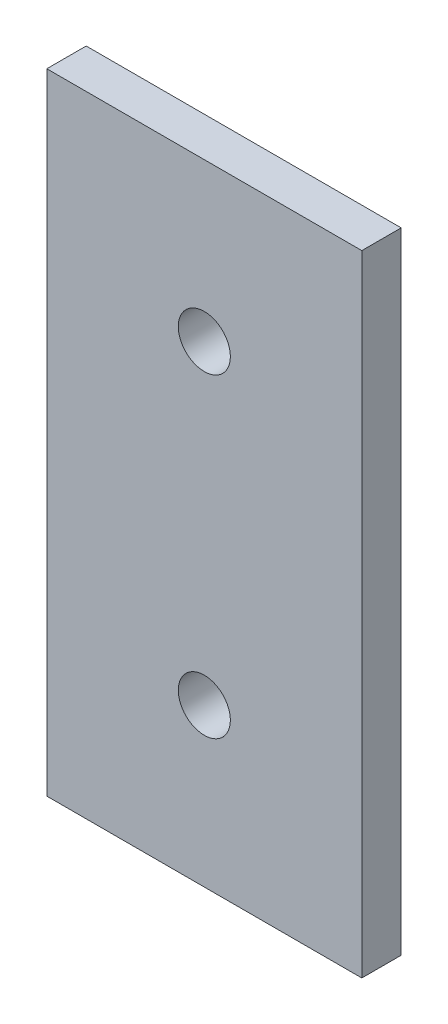
ISO-10303-21;
HEADER;
FILE_DESCRIPTION(('STEP AP214'),'2;1');
FILE_NAME('part.step','',(''),(''),'','','');
FILE_SCHEMA(('AUTOMOTIVE_DESIGN { 1 0 10303 214 1 1 1 1 }'));
ENDSEC;
DATA;
#1=APPLICATION_CONTEXT('core data for automotive mechanical design processes');
#2=APPLICATION_PROTOCOL_DEFINITION('international standard','automotive_design',2000,#1);
#3=PRODUCT_CONTEXT('',#1,'mechanical');
#4=PRODUCT('Part','Part','',(#3));
#5=PRODUCT_RELATED_PRODUCT_CATEGORY('part','',(#4));
#6=PRODUCT_DEFINITION_FORMATION('','',#4);
#7=PRODUCT_DEFINITION_CONTEXT('part definition',#1,'design');
#8=PRODUCT_DEFINITION('design','',#6,#7);
#9=PRODUCT_DEFINITION_SHAPE('','',#8);
#10=(LENGTH_UNIT() NAMED_UNIT(*) SI_UNIT(.MILLI.,.METRE.));
#11=(NAMED_UNIT(*) PLANE_ANGLE_UNIT() SI_UNIT($,.RADIAN.));
#12=(NAMED_UNIT(*) SI_UNIT($,.STERADIAN.) SOLID_ANGLE_UNIT());
#13=UNCERTAINTY_MEASURE_WITH_UNIT(LENGTH_MEASURE(1.E-05),#10,'distance_accuracy_value','');
#14=(GEOMETRIC_REPRESENTATION_CONTEXT(3) GLOBAL_UNCERTAINTY_ASSIGNED_CONTEXT((#13)) GLOBAL_UNIT_ASSIGNED_CONTEXT((#10,
#11,#12)) REPRESENTATION_CONTEXT('',''));
#15=CARTESIAN_POINT('',(0.,0.,0.));
#16=DIRECTION('',(0.,0.,1.));
#17=DIRECTION('',(1.,0.,0.));
#18=AXIS2_PLACEMENT_3D('',#15,#16,#17);
#19=CARTESIAN_POINT('',(0.,0.,3.175));
#20=DIRECTION('',(0.,0.,-1.));
#21=DIRECTION('',(-1.,0.,0.));
#22=AXIS2_PLACEMENT_3D('',#19,#20,#21);
#23=PLANE('',#22);
#24=DIRECTION('',(0.,1.,0.));
#25=VECTOR('',#24,1.);
#26=CARTESIAN_POINT('',(12.7,-25.4,3.175));
#27=LINE('',#26,#25);
#28=CARTESIAN_POINT('',(12.7,-25.4,3.175));
#29=VERTEX_POINT('',#28);
#30=CARTESIAN_POINT('',(12.7,25.4,3.175));
#31=VERTEX_POINT('',#30);
#32=EDGE_CURVE('E92',#29,#31,#27,.T.);
#33=ORIENTED_EDGE('',*,*,#32,.T.);
#34=DIRECTION('',(-1.,0.,0.));
#35=VECTOR('',#34,1.);
#36=CARTESIAN_POINT('',(-12.7,25.4,3.175));
#37=LINE('',#36,#35);
#38=CARTESIAN_POINT('',(-12.7,25.4,3.175));
#39=VERTEX_POINT('',#38);
#40=EDGE_CURVE('E87',#31,#39,#37,.T.);
#41=ORIENTED_EDGE('',*,*,#40,.T.);
#42=DIRECTION('',(0.,-1.,0.));
#43=VECTOR('',#42,1.);
#44=CARTESIAN_POINT('',(-12.7,-25.4,3.175));
#45=LINE('',#44,#43);
#46=CARTESIAN_POINT('',(-12.7,-25.4,3.175));
#47=VERTEX_POINT('',#46);
#48=EDGE_CURVE('E90',#39,#47,#45,.T.);
#49=ORIENTED_EDGE('',*,*,#48,.T.);
#50=DIRECTION('',(1.,0.,0.));
#51=VECTOR('',#50,1.);
#52=CARTESIAN_POINT('',(-12.7,-25.4,3.175));
#53=LINE('',#52,#51);
#54=EDGE_CURVE('E57',#47,#29,#53,.T.);
#55=ORIENTED_EDGE('',*,*,#54,.T.);
#56=EDGE_LOOP('',(#33,#41,#49,#55));
#57=FACE_BOUND('',#56,.T.);
#58=CARTESIAN_POINT('',(0.,12.7,3.175));
#59=DIRECTION('',(0.,0.,1.));
#60=DIRECTION('',(1.,0.,0.));
#61=AXIS2_PLACEMENT_3D('',#58,#59,#60);
#62=CIRCLE('',#61,2.1);
#63=CARTESIAN_POINT('',(2.1,12.7,3.175));
#64=VERTEX_POINT('',#63);
#65=EDGE_CURVE('E112',#64,#64,#62,.T.);
#66=ORIENTED_EDGE('',*,*,#65,.F.);
#67=EDGE_LOOP('',(#66));
#68=FACE_BOUND('',#67,.T.);
#69=CARTESIAN_POINT('',(0.,-12.7,3.175));
#70=DIRECTION('',(0.,0.,1.));
#71=DIRECTION('',(1.,0.,0.));
#72=AXIS2_PLACEMENT_3D('',#69,#70,#71);
#73=CIRCLE('',#72,2.1);
#74=CARTESIAN_POINT('',(2.1,-12.7,3.175));
#75=VERTEX_POINT('',#74);
#76=EDGE_CURVE('E134',#75,#75,#73,.T.);
#77=ORIENTED_EDGE('',*,*,#76,.F.);
#78=EDGE_LOOP('',(#77));
#79=FACE_BOUND('',#78,.T.);
#80=ADVANCED_FACE('F39',(#57,#68,#79),#23,.F.);
#81=CARTESIAN_POINT('',(0.,0.,0.));
#82=DIRECTION('',(0.,0.,-1.));
#83=DIRECTION('',(-1.,0.,0.));
#84=AXIS2_PLACEMENT_3D('',#81,#82,#83);
#85=PLANE('',#84);
#86=CARTESIAN_POINT('',(0.,12.7,0.));
#87=DIRECTION('',(0.,0.,1.));
#88=DIRECTION('',(1.,0.,0.));
#89=AXIS2_PLACEMENT_3D('',#86,#87,#88);
#90=CIRCLE('',#89,2.1);
#91=CARTESIAN_POINT('',(2.1,12.7,0.));
#92=VERTEX_POINT('',#91);
#93=EDGE_CURVE('E130',#92,#92,#90,.T.);
#94=ORIENTED_EDGE('',*,*,#93,.T.);
#95=EDGE_LOOP('',(#94));
#96=FACE_BOUND('',#95,.T.);
#97=DIRECTION('',(0.,1.,0.));
#98=VECTOR('',#97,1.);
#99=CARTESIAN_POINT('',(12.7,-25.4,0.));
#100=LINE('',#99,#98);
#101=CARTESIAN_POINT('',(12.7,-25.4,0.));
#102=VERTEX_POINT('',#101);
#103=CARTESIAN_POINT('',(12.7,25.4,0.));
#104=VERTEX_POINT('',#103);
#105=EDGE_CURVE('E108',#102,#104,#100,.T.);
#106=ORIENTED_EDGE('',*,*,#105,.F.);
#107=DIRECTION('',(1.,0.,0.));
#108=VECTOR('',#107,1.);
#109=CARTESIAN_POINT('',(-12.7,-25.4,0.));
#110=LINE('',#109,#108);
#111=CARTESIAN_POINT('',(-12.7,-25.4,0.));
#112=VERTEX_POINT('',#111);
#113=EDGE_CURVE('E80',#112,#102,#110,.T.);
#114=ORIENTED_EDGE('',*,*,#113,.F.);
#115=DIRECTION('',(0.,-1.,0.));
#116=VECTOR('',#115,1.);
#117=CARTESIAN_POINT('',(-12.7,-25.4,0.));
#118=LINE('',#117,#116);
#119=CARTESIAN_POINT('',(-12.7,25.4,0.));
#120=VERTEX_POINT('',#119);
#121=EDGE_CURVE('E74',#120,#112,#118,.T.);
#122=ORIENTED_EDGE('',*,*,#121,.F.);
#123=DIRECTION('',(-1.,0.,0.));
#124=VECTOR('',#123,1.);
#125=CARTESIAN_POINT('',(-12.7,25.4,0.));
#126=LINE('',#125,#124);
#127=EDGE_CURVE('E97',#104,#120,#126,.T.);
#128=ORIENTED_EDGE('',*,*,#127,.F.);
#129=EDGE_LOOP('',(#106,#114,#122,#128));
#130=FACE_BOUND('',#129,.T.);
#131=CARTESIAN_POINT('',(0.,-12.7,0.));
#132=DIRECTION('',(0.,0.,1.));
#133=DIRECTION('',(1.,0.,0.));
#134=AXIS2_PLACEMENT_3D('',#131,#132,#133);
#135=CIRCLE('',#134,2.1);
#136=CARTESIAN_POINT('',(2.1,-12.7,0.));
#137=VERTEX_POINT('',#136);
#138=EDGE_CURVE('E138',#137,#137,#135,.T.);
#139=ORIENTED_EDGE('',*,*,#138,.T.);
#140=EDGE_LOOP('',(#139));
#141=FACE_BOUND('',#140,.T.);
#142=ADVANCED_FACE('F125',(#96,#130,#141),#85,.T.);
#143=CARTESIAN_POINT('',(12.7,-25.4,3.175));
#144=DIRECTION('',(-1.,0.,0.));
#145=DIRECTION('',(0.,0.,1.));
#146=AXIS2_PLACEMENT_3D('',#143,#144,#145);
#147=PLANE('',#146);
#148=ORIENTED_EDGE('',*,*,#105,.T.);
#149=DIRECTION('',(0.,0.,-1.));
#150=VECTOR('',#149,1.);
#151=CARTESIAN_POINT('',(12.7,25.4,3.175));
#152=LINE('',#151,#150);
#153=EDGE_CURVE('E11',#31,#104,#152,.T.);
#154=ORIENTED_EDGE('',*,*,#153,.F.);
#155=ORIENTED_EDGE('',*,*,#32,.F.);
#156=DIRECTION('',(0.,0.,-1.));
#157=VECTOR('',#156,1.);
#158=CARTESIAN_POINT('',(12.7,-25.4,3.175));
#159=LINE('',#158,#157);
#160=EDGE_CURVE('E104',#29,#102,#159,.T.);
#161=ORIENTED_EDGE('',*,*,#160,.T.);
#162=EDGE_LOOP('',(#148,#154,#155,#161));
#163=FACE_BOUND('',#162,.T.);
#164=ADVANCED_FACE('F41',(#163),#147,.F.);
#165=CARTESIAN_POINT('',(-12.7,25.4,3.175));
#166=DIRECTION('',(0.,-1.,0.));
#167=DIRECTION('',(0.,0.,-1.));
#168=AXIS2_PLACEMENT_3D('',#165,#166,#167);
#169=PLANE('',#168);
#170=ORIENTED_EDGE('',*,*,#127,.T.);
#171=DIRECTION('',(0.,0.,-1.));
#172=VECTOR('',#171,1.);
#173=CARTESIAN_POINT('',(-12.7,25.4,3.175));
#174=LINE('',#173,#172);
#175=EDGE_CURVE('E49',#39,#120,#174,.T.);
#176=ORIENTED_EDGE('',*,*,#175,.F.);
#177=ORIENTED_EDGE('',*,*,#40,.F.);
#178=ORIENTED_EDGE('',*,*,#153,.T.);
#179=EDGE_LOOP('',(#170,#176,#177,#178));
#180=FACE_BOUND('',#179,.T.);
#181=ADVANCED_FACE('F96',(#180),#169,.F.);
#182=CARTESIAN_POINT('',(-12.7,-25.4,3.175));
#183=DIRECTION('',(1.,0.,0.));
#184=DIRECTION('',(0.,0.,-1.));
#185=AXIS2_PLACEMENT_3D('',#182,#183,#184);
#186=PLANE('',#185);
#187=ORIENTED_EDGE('',*,*,#121,.T.);
#188=DIRECTION('',(0.,0.,-1.));
#189=VECTOR('',#188,1.);
#190=CARTESIAN_POINT('',(-12.7,-25.4,3.175));
#191=LINE('',#190,#189);
#192=EDGE_CURVE('E99',#47,#112,#191,.T.);
#193=ORIENTED_EDGE('',*,*,#192,.F.);
#194=ORIENTED_EDGE('',*,*,#48,.F.);
#195=ORIENTED_EDGE('',*,*,#175,.T.);
#196=EDGE_LOOP('',(#187,#193,#194,#195));
#197=FACE_BOUND('',#196,.T.);
#198=ADVANCED_FACE('F100',(#197),#186,.F.);
#199=CARTESIAN_POINT('',(-12.7,-25.4,3.175));
#200=DIRECTION('',(0.,1.,0.));
#201=DIRECTION('',(0.,0.,1.));
#202=AXIS2_PLACEMENT_3D('',#199,#200,#201);
#203=PLANE('',#202);
#204=ORIENTED_EDGE('',*,*,#113,.T.);
#205=ORIENTED_EDGE('',*,*,#160,.F.);
#206=ORIENTED_EDGE('',*,*,#54,.F.);
#207=ORIENTED_EDGE('',*,*,#192,.T.);
#208=EDGE_LOOP('',(#204,#205,#206,#207));
#209=FACE_BOUND('',#208,.T.);
#210=ADVANCED_FACE('F122',(#209),#203,.F.);
#211=CARTESIAN_POINT('',(0.,12.7,3.175));
#212=DIRECTION('',(0.,0.,-1.));
#213=DIRECTION('',(-1.,0.,0.));
#214=AXIS2_PLACEMENT_3D('',#211,#212,#213);
#215=CYLINDRICAL_SURFACE('',#214,2.1);
#216=ORIENTED_EDGE('',*,*,#65,.T.);
#217=EDGE_LOOP('',(#216));
#218=FACE_BOUND('',#217,.T.);
#219=ORIENTED_EDGE('',*,*,#93,.F.);
#220=EDGE_LOOP('',(#219));
#221=FACE_BOUND('',#220,.T.);
#222=ADVANCED_FACE('F157',(#218,#221),#215,.F.);
#223=CARTESIAN_POINT('',(0.,-12.7,3.175));
#224=DIRECTION('',(0.,0.,-1.));
#225=DIRECTION('',(-1.,0.,0.));
#226=AXIS2_PLACEMENT_3D('',#223,#224,#225);
#227=CYLINDRICAL_SURFACE('',#226,2.1);
#228=ORIENTED_EDGE('',*,*,#76,.T.);
#229=EDGE_LOOP('',(#228));
#230=FACE_BOUND('',#229,.T.);
#231=ORIENTED_EDGE('',*,*,#138,.F.);
#232=EDGE_LOOP('',(#231));
#233=FACE_BOUND('',#232,.T.);
#234=ADVANCED_FACE('F146',(#230,#233),#227,.F.);
#235=CLOSED_SHELL('',(#80,#142,#164,#181,#198,#210,#222,#234));
#236=MANIFOLD_SOLID_BREP('B2',#235);
#237=ADVANCED_BREP_SHAPE_REPRESENTATION('',(#18,#236),#14);
#238=SHAPE_DEFINITION_REPRESENTATION(#9,#237);
ENDSEC;
END-ISO-10303-21;
